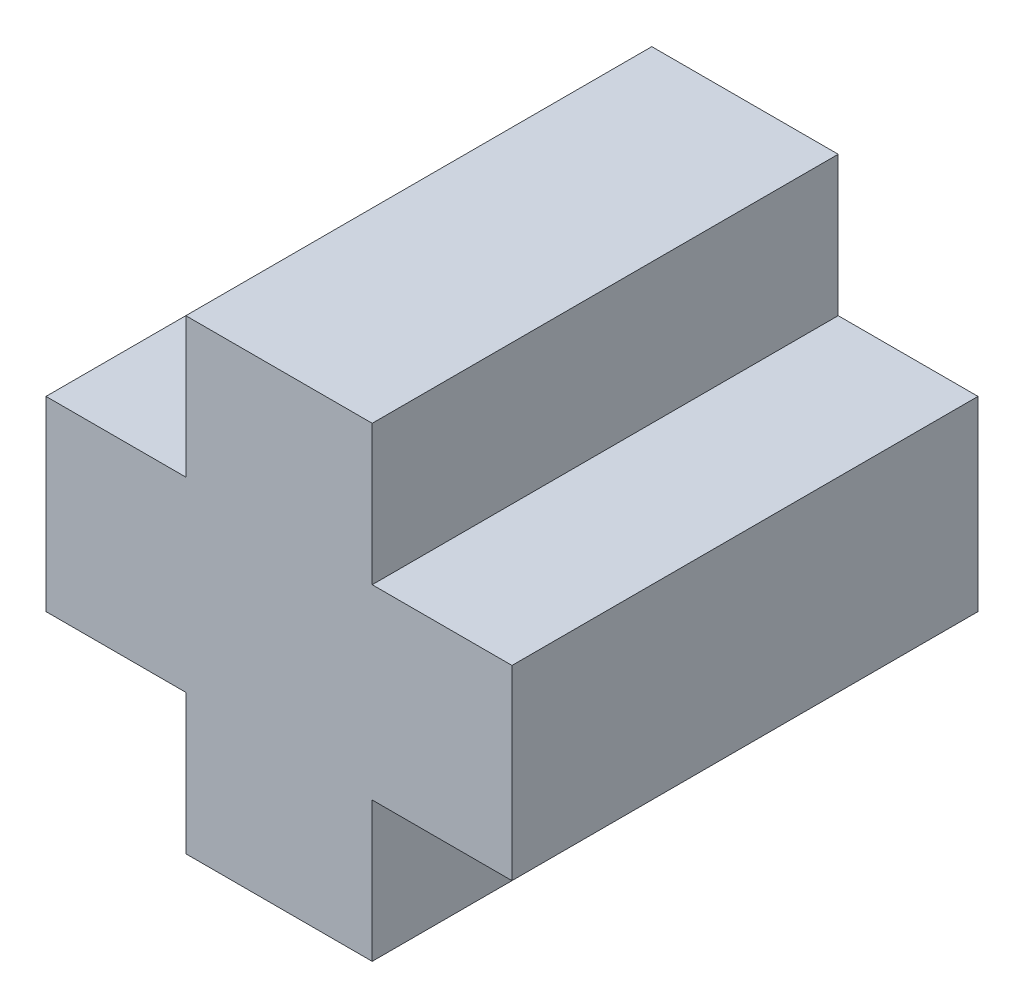
ISO-10303-21;
HEADER;
FILE_DESCRIPTION(('STEP AP214'),'2;1');
FILE_NAME('part.step','',(''),(''),'','','');
FILE_SCHEMA(('AUTOMOTIVE_DESIGN { 1 0 10303 214 1 1 1 1 }'));
ENDSEC;
DATA;
#1=APPLICATION_CONTEXT('core data for automotive mechanical design processes');
#2=APPLICATION_PROTOCOL_DEFINITION('international standard','automotive_design',2000,#1);
#3=PRODUCT_CONTEXT('',#1,'mechanical');
#4=PRODUCT('Part','Part','',(#3));
#5=PRODUCT_RELATED_PRODUCT_CATEGORY('part','',(#4));
#6=PRODUCT_DEFINITION_FORMATION('','',#4);
#7=PRODUCT_DEFINITION_CONTEXT('part definition',#1,'design');
#8=PRODUCT_DEFINITION('design','',#6,#7);
#9=PRODUCT_DEFINITION_SHAPE('','',#8);
#10=(LENGTH_UNIT() NAMED_UNIT(*) SI_UNIT(.MILLI.,.METRE.));
#11=(NAMED_UNIT(*) PLANE_ANGLE_UNIT() SI_UNIT($,.RADIAN.));
#12=(NAMED_UNIT(*) SI_UNIT($,.STERADIAN.) SOLID_ANGLE_UNIT());
#13=UNCERTAINTY_MEASURE_WITH_UNIT(LENGTH_MEASURE(1.E-05),#10,'distance_accuracy_value','');
#14=(GEOMETRIC_REPRESENTATION_CONTEXT(3) GLOBAL_UNCERTAINTY_ASSIGNED_CONTEXT((#13)) GLOBAL_UNIT_ASSIGNED_CONTEXT((#10,
#11,#12)) REPRESENTATION_CONTEXT('',''));
#15=CARTESIAN_POINT('',(0.,0.,0.));
#16=DIRECTION('',(0.,0.,1.));
#17=DIRECTION('',(1.,0.,0.));
#18=AXIS2_PLACEMENT_3D('',#15,#16,#17);
#19=CARTESIAN_POINT('',(-1.94927536231885,6.54710144927536,10.));
#20=DIRECTION('',(0.,-1.,0.));
#21=DIRECTION('',(1.,0.,0.));
#22=AXIS2_PLACEMENT_3D('',#19,#20,#21);
#23=PLANE('',#22);
#24=DIRECTION('',(-1.,0.,0.));
#25=VECTOR('',#24,1.);
#26=CARTESIAN_POINT('',(-1.94927536231885,6.54710144927536,0.));
#27=LINE('',#26,#25);
#28=CARTESIAN_POINT('',(-1.94927536231885,6.54710144927536,0.));
#29=VERTEX_POINT('',#28);
#30=CARTESIAN_POINT('',(-5.94927536231885,6.54710144927536,0.));
#31=VERTEX_POINT('',#30);
#32=EDGE_CURVE('E153',#29,#31,#27,.T.);
#33=ORIENTED_EDGE('',*,*,#32,.T.);
#34=DIRECTION('',(0.,0.,-1.));
#35=VECTOR('',#34,1.);
#36=CARTESIAN_POINT('',(-5.94927536231885,6.54710144927536,10.));
#37=LINE('',#36,#35);
#38=CARTESIAN_POINT('',(-5.94927536231885,6.54710144927536,10.));
#39=VERTEX_POINT('',#38);
#40=EDGE_CURVE('E11',#39,#31,#37,.T.);
#41=ORIENTED_EDGE('',*,*,#40,.F.);
#42=DIRECTION('',(-1.,0.,0.));
#43=VECTOR('',#42,1.);
#44=CARTESIAN_POINT('',(-1.94927536231885,6.54710144927536,10.));
#45=LINE('',#44,#43);
#46=CARTESIAN_POINT('',(-1.94927536231885,6.54710144927536,10.));
#47=VERTEX_POINT('',#46);
#48=EDGE_CURVE('E175',#47,#39,#45,.T.);
#49=ORIENTED_EDGE('',*,*,#48,.F.);
#50=DIRECTION('',(0.,0.,-1.));
#51=VECTOR('',#50,1.);
#52=CARTESIAN_POINT('',(-1.94927536231885,6.54710144927536,10.));
#53=LINE('',#52,#51);
#54=EDGE_CURVE('E149',#47,#29,#53,.T.);
#55=ORIENTED_EDGE('',*,*,#54,.T.);
#56=EDGE_LOOP('',(#33,#41,#49,#55));
#57=FACE_BOUND('',#56,.T.);
#58=ADVANCED_FACE('F33',(#57),#23,.F.);
#59=CARTESIAN_POINT('',(-5.94927536231885,6.54710144927536,10.));
#60=DIRECTION('',(1.,0.,0.));
#61=DIRECTION('',(0.,0.,-1.));
#62=AXIS2_PLACEMENT_3D('',#59,#60,#61);
#63=PLANE('',#62);
#64=DIRECTION('',(0.,-1.,0.));
#65=VECTOR('',#64,1.);
#66=CARTESIAN_POINT('',(-5.94927536231885,6.54710144927536,0.));
#67=LINE('',#66,#65);
#68=CARTESIAN_POINT('',(-5.94927536231885,3.54710144927536,0.));
#69=VERTEX_POINT('',#68);
#70=EDGE_CURVE('E156',#31,#69,#67,.T.);
#71=ORIENTED_EDGE('',*,*,#70,.T.);
#72=DIRECTION('',(0.,0.,-1.));
#73=VECTOR('',#72,1.);
#74=CARTESIAN_POINT('',(-5.94927536231885,3.54710144927536,10.));
#75=LINE('',#74,#73);
#76=CARTESIAN_POINT('',(-5.94927536231885,3.54710144927536,10.));
#77=VERTEX_POINT('',#76);
#78=EDGE_CURVE('E41',#77,#69,#75,.T.);
#79=ORIENTED_EDGE('',*,*,#78,.F.);
#80=DIRECTION('',(0.,-1.,0.));
#81=VECTOR('',#80,1.);
#82=CARTESIAN_POINT('',(-5.94927536231885,6.54710144927536,10.));
#83=LINE('',#82,#81);
#84=EDGE_CURVE('E104',#39,#77,#83,.T.);
#85=ORIENTED_EDGE('',*,*,#84,.F.);
#86=ORIENTED_EDGE('',*,*,#40,.T.);
#87=EDGE_LOOP('',(#71,#79,#85,#86));
#88=FACE_BOUND('',#87,.T.);
#89=ADVANCED_FACE('F253',(#88),#63,.F.);
#90=CARTESIAN_POINT('',(-5.94927536231885,3.54710144927536,10.));
#91=DIRECTION('',(0.,-1.,0.));
#92=DIRECTION('',(1.,0.,0.));
#93=AXIS2_PLACEMENT_3D('',#90,#91,#92);
#94=PLANE('',#93);
#95=DIRECTION('',(-1.,0.,0.));
#96=VECTOR('',#95,1.);
#97=CARTESIAN_POINT('',(-5.94927536231885,3.54710144927536,0.));
#98=LINE('',#97,#96);
#99=CARTESIAN_POINT('',(-8.94927536231885,3.54710144927536,0.));
#100=VERTEX_POINT('',#99);
#101=EDGE_CURVE('E158',#69,#100,#98,.T.);
#102=ORIENTED_EDGE('',*,*,#101,.T.);
#103=DIRECTION('',(0.,0.,-1.));
#104=VECTOR('',#103,1.);
#105=CARTESIAN_POINT('',(-8.94927536231885,3.54710144927536,10.));
#106=LINE('',#105,#104);
#107=CARTESIAN_POINT('',(-8.94927536231885,3.54710144927536,10.));
#108=VERTEX_POINT('',#107);
#109=EDGE_CURVE('E194',#108,#100,#106,.T.);
#110=ORIENTED_EDGE('',*,*,#109,.F.);
#111=DIRECTION('',(-1.,0.,0.));
#112=VECTOR('',#111,1.);
#113=CARTESIAN_POINT('',(-5.94927536231885,3.54710144927536,10.));
#114=LINE('',#113,#112);
#115=EDGE_CURVE('E202',#77,#108,#114,.T.);
#116=ORIENTED_EDGE('',*,*,#115,.F.);
#117=ORIENTED_EDGE('',*,*,#78,.T.);
#118=EDGE_LOOP('',(#102,#110,#116,#117));
#119=FACE_BOUND('',#118,.T.);
#120=ADVANCED_FACE('F200',(#119),#94,.F.);
#121=CARTESIAN_POINT('',(-8.94927536231885,3.54710144927536,10.));
#122=DIRECTION('',(1.,0.,0.));
#123=DIRECTION('',(0.,0.,-1.));
#124=AXIS2_PLACEMENT_3D('',#121,#122,#123);
#125=PLANE('',#124);
#126=DIRECTION('',(0.,-1.,0.));
#127=VECTOR('',#126,1.);
#128=CARTESIAN_POINT('',(-8.94927536231885,3.54710144927536,0.));
#129=LINE('',#128,#127);
#130=CARTESIAN_POINT('',(-8.94927536231885,-0.452898550724638,0.));
#131=VERTEX_POINT('',#130);
#132=EDGE_CURVE('E160',#100,#131,#129,.T.);
#133=ORIENTED_EDGE('',*,*,#132,.T.);
#134=DIRECTION('',(0.,0.,-1.));
#135=VECTOR('',#134,1.);
#136=CARTESIAN_POINT('',(-8.94927536231885,-0.452898550724638,10.));
#137=LINE('',#136,#135);
#138=CARTESIAN_POINT('',(-8.94927536231885,-0.452898550724638,10.));
#139=VERTEX_POINT('',#138);
#140=EDGE_CURVE('E191',#139,#131,#137,.T.);
#141=ORIENTED_EDGE('',*,*,#140,.F.);
#142=DIRECTION('',(0.,-1.,0.));
#143=VECTOR('',#142,1.);
#144=CARTESIAN_POINT('',(-8.94927536231885,3.54710144927536,10.));
#145=LINE('',#144,#143);
#146=EDGE_CURVE('E220',#108,#139,#145,.T.);
#147=ORIENTED_EDGE('',*,*,#146,.F.);
#148=ORIENTED_EDGE('',*,*,#109,.T.);
#149=EDGE_LOOP('',(#133,#141,#147,#148));
#150=FACE_BOUND('',#149,.T.);
#151=ADVANCED_FACE('F211',(#150),#125,.F.);
#152=CARTESIAN_POINT('',(-8.94927536231885,-0.452898550724638,10.));
#153=DIRECTION('',(0.,1.,0.));
#154=DIRECTION('',(-1.,0.,0.));
#155=AXIS2_PLACEMENT_3D('',#152,#153,#154);
#156=PLANE('',#155);
#157=DIRECTION('',(1.,0.,0.));
#158=VECTOR('',#157,1.);
#159=CARTESIAN_POINT('',(-8.94927536231885,-0.452898550724638,0.));
#160=LINE('',#159,#158);
#161=CARTESIAN_POINT('',(-5.94927536231885,-0.452898550724639,0.));
#162=VERTEX_POINT('',#161);
#163=EDGE_CURVE('E162',#131,#162,#160,.T.);
#164=ORIENTED_EDGE('',*,*,#163,.T.);
#165=DIRECTION('',(0.,0.,-1.));
#166=VECTOR('',#165,1.);
#167=CARTESIAN_POINT('',(-5.94927536231885,-0.452898550724639,10.));
#168=LINE('',#167,#166);
#169=CARTESIAN_POINT('',(-5.94927536231885,-0.452898550724639,10.));
#170=VERTEX_POINT('',#169);
#171=EDGE_CURVE('E188',#170,#162,#168,.T.);
#172=ORIENTED_EDGE('',*,*,#171,.F.);
#173=DIRECTION('',(1.,0.,0.));
#174=VECTOR('',#173,1.);
#175=CARTESIAN_POINT('',(-8.94927536231885,-0.452898550724638,10.));
#176=LINE('',#175,#174);
#177=EDGE_CURVE('E217',#139,#170,#176,.T.);
#178=ORIENTED_EDGE('',*,*,#177,.F.);
#179=ORIENTED_EDGE('',*,*,#140,.T.);
#180=EDGE_LOOP('',(#164,#172,#178,#179));
#181=FACE_BOUND('',#180,.T.);
#182=ADVANCED_FACE('F215',(#181),#156,.F.);
#183=CARTESIAN_POINT('',(-5.94927536231885,-0.452898550724639,10.));
#184=DIRECTION('',(1.,0.,0.));
#185=DIRECTION('',(0.,1.,0.));
#186=AXIS2_PLACEMENT_3D('',#183,#184,#185);
#187=PLANE('',#186);
#188=DIRECTION('',(0.,-1.,0.));
#189=VECTOR('',#188,1.);
#190=CARTESIAN_POINT('',(-5.94927536231885,-0.452898550724639,0.));
#191=LINE('',#190,#189);
#192=CARTESIAN_POINT('',(-5.94927536231884,-3.45289855072464,0.));
#193=VERTEX_POINT('',#192);
#194=EDGE_CURVE('E164',#162,#193,#191,.T.);
#195=ORIENTED_EDGE('',*,*,#194,.T.);
#196=DIRECTION('',(0.,0.,-1.));
#197=VECTOR('',#196,1.);
#198=CARTESIAN_POINT('',(-5.94927536231884,-3.45289855072464,10.));
#199=LINE('',#198,#197);
#200=CARTESIAN_POINT('',(-5.94927536231884,-3.45289855072464,10.));
#201=VERTEX_POINT('',#200);
#202=EDGE_CURVE('E185',#201,#193,#199,.T.);
#203=ORIENTED_EDGE('',*,*,#202,.F.);
#204=DIRECTION('',(0.,-1.,0.));
#205=VECTOR('',#204,1.);
#206=CARTESIAN_POINT('',(-5.94927536231885,-0.452898550724639,10.));
#207=LINE('',#206,#205);
#208=EDGE_CURVE('E219',#170,#201,#207,.T.);
#209=ORIENTED_EDGE('',*,*,#208,.F.);
#210=ORIENTED_EDGE('',*,*,#171,.T.);
#211=EDGE_LOOP('',(#195,#203,#209,#210));
#212=FACE_BOUND('',#211,.T.);
#213=ADVANCED_FACE('F266',(#212),#187,.F.);
#214=CARTESIAN_POINT('',(-5.94927536231884,-3.45289855072464,10.));
#215=DIRECTION('',(0.,1.,0.));
#216=DIRECTION('',(-1.,0.,0.));
#217=AXIS2_PLACEMENT_3D('',#214,#215,#216);
#218=PLANE('',#217);
#219=DIRECTION('',(1.,0.,0.));
#220=VECTOR('',#219,1.);
#221=CARTESIAN_POINT('',(-5.94927536231884,-3.45289855072464,0.));
#222=LINE('',#221,#220);
#223=CARTESIAN_POINT('',(-1.94927536231885,-3.45289855072464,0.));
#224=VERTEX_POINT('',#223);
#225=EDGE_CURVE('E166',#193,#224,#222,.T.);
#226=ORIENTED_EDGE('',*,*,#225,.T.);
#227=DIRECTION('',(0.,0.,-1.));
#228=VECTOR('',#227,1.);
#229=CARTESIAN_POINT('',(-1.94927536231885,-3.45289855072464,10.));
#230=LINE('',#229,#228);
#231=CARTESIAN_POINT('',(-1.94927536231885,-3.45289855072464,10.));
#232=VERTEX_POINT('',#231);
#233=EDGE_CURVE('E182',#232,#224,#230,.T.);
#234=ORIENTED_EDGE('',*,*,#233,.F.);
#235=DIRECTION('',(1.,0.,0.));
#236=VECTOR('',#235,1.);
#237=CARTESIAN_POINT('',(-5.94927536231884,-3.45289855072464,10.));
#238=LINE('',#237,#236);
#239=EDGE_CURVE('E222',#201,#232,#238,.T.);
#240=ORIENTED_EDGE('',*,*,#239,.F.);
#241=ORIENTED_EDGE('',*,*,#202,.T.);
#242=EDGE_LOOP('',(#226,#234,#240,#241));
#243=FACE_BOUND('',#242,.T.);
#244=ADVANCED_FACE('F269',(#243),#218,.F.);
#245=CARTESIAN_POINT('',(-1.94927536231885,-3.45289855072464,10.));
#246=DIRECTION('',(-1.,0.,0.));
#247=DIRECTION('',(0.,0.,1.));
#248=AXIS2_PLACEMENT_3D('',#245,#246,#247);
#249=PLANE('',#248);
#250=DIRECTION('',(0.,1.,0.));
#251=VECTOR('',#250,1.);
#252=CARTESIAN_POINT('',(-1.94927536231885,-3.45289855072464,0.));
#253=LINE('',#252,#251);
#254=CARTESIAN_POINT('',(-1.94927536231885,-0.452898550724638,0.));
#255=VERTEX_POINT('',#254);
#256=EDGE_CURVE('E168',#224,#255,#253,.T.);
#257=ORIENTED_EDGE('',*,*,#256,.T.);
#258=DIRECTION('',(0.,0.,-1.));
#259=VECTOR('',#258,1.);
#260=CARTESIAN_POINT('',(-1.94927536231885,-0.452898550724638,10.));
#261=LINE('',#260,#259);
#262=CARTESIAN_POINT('',(-1.94927536231885,-0.452898550724638,10.));
#263=VERTEX_POINT('',#262);
#264=EDGE_CURVE('E179',#263,#255,#261,.T.);
#265=ORIENTED_EDGE('',*,*,#264,.F.);
#266=DIRECTION('',(0.,1.,0.));
#267=VECTOR('',#266,1.);
#268=CARTESIAN_POINT('',(-1.94927536231885,-3.45289855072464,10.));
#269=LINE('',#268,#267);
#270=EDGE_CURVE('E228',#232,#263,#269,.T.);
#271=ORIENTED_EDGE('',*,*,#270,.F.);
#272=ORIENTED_EDGE('',*,*,#233,.T.);
#273=EDGE_LOOP('',(#257,#265,#271,#272));
#274=FACE_BOUND('',#273,.T.);
#275=ADVANCED_FACE('F234',(#274),#249,.F.);
#276=CARTESIAN_POINT('',(-1.94927536231885,-0.452898550724638,10.));
#277=DIRECTION('',(0.,1.,0.));
#278=DIRECTION('',(0.,0.,1.));
#279=AXIS2_PLACEMENT_3D('',#276,#277,#278);
#280=PLANE('',#279);
#281=DIRECTION('',(1.,0.,0.));
#282=VECTOR('',#281,1.);
#283=CARTESIAN_POINT('',(-1.94927536231885,-0.452898550724638,0.));
#284=LINE('',#283,#282);
#285=CARTESIAN_POINT('',(1.05072463768115,-0.452898550724638,0.));
#286=VERTEX_POINT('',#285);
#287=EDGE_CURVE('E170',#255,#286,#284,.T.);
#288=ORIENTED_EDGE('',*,*,#287,.T.);
#289=DIRECTION('',(0.,0.,-1.));
#290=VECTOR('',#289,1.);
#291=CARTESIAN_POINT('',(1.05072463768115,-0.452898550724638,10.));
#292=LINE('',#291,#290);
#293=CARTESIAN_POINT('',(1.05072463768115,-0.452898550724638,10.));
#294=VERTEX_POINT('',#293);
#295=EDGE_CURVE('E144',#294,#286,#292,.T.);
#296=ORIENTED_EDGE('',*,*,#295,.F.);
#297=DIRECTION('',(1.,0.,0.));
#298=VECTOR('',#297,1.);
#299=CARTESIAN_POINT('',(-1.94927536231885,-0.452898550724638,10.));
#300=LINE('',#299,#298);
#301=EDGE_CURVE('E135',#263,#294,#300,.T.);
#302=ORIENTED_EDGE('',*,*,#301,.F.);
#303=ORIENTED_EDGE('',*,*,#264,.T.);
#304=EDGE_LOOP('',(#288,#296,#302,#303));
#305=FACE_BOUND('',#304,.T.);
#306=ADVANCED_FACE('F238',(#305),#280,.F.);
#307=CARTESIAN_POINT('',(1.05072463768115,-0.452898550724638,10.));
#308=DIRECTION('',(-1.,0.,0.));
#309=DIRECTION('',(0.,-1.,0.));
#310=AXIS2_PLACEMENT_3D('',#307,#308,#309);
#311=PLANE('',#310);
#312=DIRECTION('',(0.,1.,0.));
#313=VECTOR('',#312,1.);
#314=CARTESIAN_POINT('',(1.05072463768115,-0.452898550724638,0.));
#315=LINE('',#314,#313);
#316=CARTESIAN_POINT('',(1.05072463768115,3.54710144927536,0.));
#317=VERTEX_POINT('',#316);
#318=EDGE_CURVE('E143',#286,#317,#315,.T.);
#319=ORIENTED_EDGE('',*,*,#318,.T.);
#320=DIRECTION('',(0.,0.,-1.));
#321=VECTOR('',#320,1.);
#322=CARTESIAN_POINT('',(1.05072463768115,3.54710144927536,10.));
#323=LINE('',#322,#321);
#324=CARTESIAN_POINT('',(1.05072463768115,3.54710144927536,10.));
#325=VERTEX_POINT('',#324);
#326=EDGE_CURVE('E140',#325,#317,#323,.T.);
#327=ORIENTED_EDGE('',*,*,#326,.F.);
#328=DIRECTION('',(0.,1.,0.));
#329=VECTOR('',#328,1.);
#330=CARTESIAN_POINT('',(1.05072463768115,-0.452898550724638,10.));
#331=LINE('',#330,#329);
#332=EDGE_CURVE('E129',#294,#325,#331,.T.);
#333=ORIENTED_EDGE('',*,*,#332,.F.);
#334=ORIENTED_EDGE('',*,*,#295,.T.);
#335=EDGE_LOOP('',(#319,#327,#333,#334));
#336=FACE_BOUND('',#335,.T.);
#337=ADVANCED_FACE('F141',(#336),#311,.F.);
#338=CARTESIAN_POINT('',(1.05072463768115,3.54710144927536,10.));
#339=DIRECTION('',(0.,-1.,0.));
#340=DIRECTION('',(1.,0.,0.));
#341=AXIS2_PLACEMENT_3D('',#338,#339,#340);
#342=PLANE('',#341);
#343=DIRECTION('',(-1.,0.,0.));
#344=VECTOR('',#343,1.);
#345=CARTESIAN_POINT('',(1.05072463768115,3.54710144927536,0.));
#346=LINE('',#345,#344);
#347=CARTESIAN_POINT('',(-1.94927536231885,3.54710144927536,0.));
#348=VERTEX_POINT('',#347);
#349=EDGE_CURVE('E90',#317,#348,#346,.T.);
#350=ORIENTED_EDGE('',*,*,#349,.T.);
#351=DIRECTION('',(0.,0.,-1.));
#352=VECTOR('',#351,1.);
#353=CARTESIAN_POINT('',(-1.94927536231885,3.54710144927536,10.));
#354=LINE('',#353,#352);
#355=CARTESIAN_POINT('',(-1.94927536231885,3.54710144927536,10.));
#356=VERTEX_POINT('',#355);
#357=EDGE_CURVE('E145',#356,#348,#354,.T.);
#358=ORIENTED_EDGE('',*,*,#357,.F.);
#359=DIRECTION('',(-1.,0.,0.));
#360=VECTOR('',#359,1.);
#361=CARTESIAN_POINT('',(1.05072463768115,3.54710144927536,10.));
#362=LINE('',#361,#360);
#363=EDGE_CURVE('E133',#325,#356,#362,.T.);
#364=ORIENTED_EDGE('',*,*,#363,.F.);
#365=ORIENTED_EDGE('',*,*,#326,.T.);
#366=EDGE_LOOP('',(#350,#358,#364,#365));
#367=FACE_BOUND('',#366,.T.);
#368=ADVANCED_FACE('F147',(#367),#342,.F.);
#369=CARTESIAN_POINT('',(-1.94927536231885,3.54710144927536,10.));
#370=DIRECTION('',(-1.,0.,0.));
#371=DIRECTION('',(0.,0.,1.));
#372=AXIS2_PLACEMENT_3D('',#369,#370,#371);
#373=PLANE('',#372);
#374=DIRECTION('',(0.,1.,0.));
#375=VECTOR('',#374,1.);
#376=CARTESIAN_POINT('',(-1.94927536231885,3.54710144927536,0.));
#377=LINE('',#376,#375);
#378=EDGE_CURVE('E96',#348,#29,#377,.T.);
#379=ORIENTED_EDGE('',*,*,#378,.T.);
#380=ORIENTED_EDGE('',*,*,#54,.F.);
#381=DIRECTION('',(0.,1.,0.));
#382=VECTOR('',#381,1.);
#383=CARTESIAN_POINT('',(-1.94927536231885,3.54710144927536,10.));
#384=LINE('',#383,#382);
#385=EDGE_CURVE('E49',#356,#47,#384,.T.);
#386=ORIENTED_EDGE('',*,*,#385,.F.);
#387=ORIENTED_EDGE('',*,*,#357,.T.);
#388=EDGE_LOOP('',(#379,#380,#386,#387));
#389=FACE_BOUND('',#388,.T.);
#390=ADVANCED_FACE('F242',(#389),#373,.F.);
#391=CARTESIAN_POINT('',(0.,0.,10.));
#392=DIRECTION('',(0.,0.,1.));
#393=DIRECTION('',(1.,0.,0.));
#394=AXIS2_PLACEMENT_3D('',#391,#392,#393);
#395=PLANE('',#394);
#396=ORIENTED_EDGE('',*,*,#48,.T.);
#397=ORIENTED_EDGE('',*,*,#84,.T.);
#398=ORIENTED_EDGE('',*,*,#115,.T.);
#399=ORIENTED_EDGE('',*,*,#146,.T.);
#400=ORIENTED_EDGE('',*,*,#177,.T.);
#401=ORIENTED_EDGE('',*,*,#208,.T.);
#402=ORIENTED_EDGE('',*,*,#239,.T.);
#403=ORIENTED_EDGE('',*,*,#270,.T.);
#404=ORIENTED_EDGE('',*,*,#301,.T.);
#405=ORIENTED_EDGE('',*,*,#332,.T.);
#406=ORIENTED_EDGE('',*,*,#363,.T.);
#407=ORIENTED_EDGE('',*,*,#385,.T.);
#408=EDGE_LOOP('',(#396,#397,#398,#399,#400,#401,#402,#403,#404,#405,#406,#407));
#409=FACE_BOUND('',#408,.T.);
#410=ADVANCED_FACE('F131',(#409),#395,.T.);
#411=CARTESIAN_POINT('',(0.,0.,0.));
#412=DIRECTION('',(0.,0.,1.));
#413=DIRECTION('',(1.,0.,0.));
#414=AXIS2_PLACEMENT_3D('',#411,#412,#413);
#415=PLANE('',#414);
#416=ORIENTED_EDGE('',*,*,#32,.F.);
#417=ORIENTED_EDGE('',*,*,#378,.F.);
#418=ORIENTED_EDGE('',*,*,#349,.F.);
#419=ORIENTED_EDGE('',*,*,#318,.F.);
#420=ORIENTED_EDGE('',*,*,#287,.F.);
#421=ORIENTED_EDGE('',*,*,#256,.F.);
#422=ORIENTED_EDGE('',*,*,#225,.F.);
#423=ORIENTED_EDGE('',*,*,#194,.F.);
#424=ORIENTED_EDGE('',*,*,#163,.F.);
#425=ORIENTED_EDGE('',*,*,#132,.F.);
#426=ORIENTED_EDGE('',*,*,#101,.F.);
#427=ORIENTED_EDGE('',*,*,#70,.F.);
#428=EDGE_LOOP('',(#416,#417,#418,#419,#420,#421,#422,#423,#424,#425,#426,#427));
#429=FACE_BOUND('',#428,.T.);
#430=ADVANCED_FACE('F206',(#429),#415,.F.);
#431=CLOSED_SHELL('',(#58,#89,#120,#151,#182,#213,#244,#275,#306,#337,#368,#390,#410,#430));
#432=MANIFOLD_SOLID_BREP('B2',#431);
#433=ADVANCED_BREP_SHAPE_REPRESENTATION('',(#18,#432),#14);
#434=SHAPE_DEFINITION_REPRESENTATION(#9,#433);
ENDSEC;
END-ISO-10303-21;
